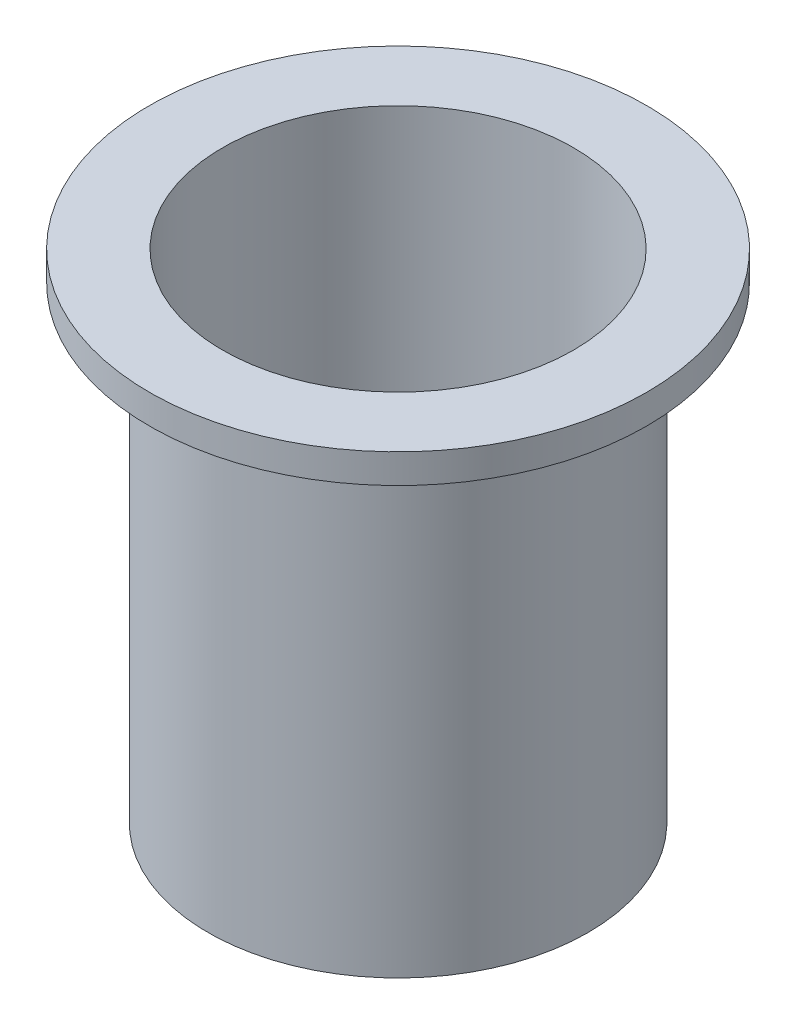
ISO-10303-21;
HEADER;
FILE_DESCRIPTION(('STEP AP214'),'2;1');
FILE_NAME('part.step','',(''),(''),'','','');
FILE_SCHEMA(('AUTOMOTIVE_DESIGN { 1 0 10303 214 1 1 1 1 }'));
ENDSEC;
DATA;
#1=APPLICATION_CONTEXT('core data for automotive mechanical design processes');
#2=APPLICATION_PROTOCOL_DEFINITION('international standard','automotive_design',2000,#1);
#3=PRODUCT_CONTEXT('',#1,'mechanical');
#4=PRODUCT('Part','Part','',(#3));
#5=PRODUCT_RELATED_PRODUCT_CATEGORY('part','',(#4));
#6=PRODUCT_DEFINITION_FORMATION('','',#4);
#7=PRODUCT_DEFINITION_CONTEXT('part definition',#1,'design');
#8=PRODUCT_DEFINITION('design','',#6,#7);
#9=PRODUCT_DEFINITION_SHAPE('','',#8);
#10=(LENGTH_UNIT() NAMED_UNIT(*) SI_UNIT(.MILLI.,.METRE.));
#11=(NAMED_UNIT(*) PLANE_ANGLE_UNIT() SI_UNIT($,.RADIAN.));
#12=(NAMED_UNIT(*) SI_UNIT($,.STERADIAN.) SOLID_ANGLE_UNIT());
#13=UNCERTAINTY_MEASURE_WITH_UNIT(LENGTH_MEASURE(1.E-05),#10,'distance_accuracy_value','');
#14=(GEOMETRIC_REPRESENTATION_CONTEXT(3) GLOBAL_UNCERTAINTY_ASSIGNED_CONTEXT((#13)) GLOBAL_UNIT_ASSIGNED_CONTEXT((#10,
#11,#12)) REPRESENTATION_CONTEXT('',''));
#15=CARTESIAN_POINT('',(0.,0.,0.));
#16=DIRECTION('',(0.,0.,1.));
#17=DIRECTION('',(1.,0.,0.));
#18=AXIS2_PLACEMENT_3D('',#15,#16,#17);
#19=CARTESIAN_POINT('',(0.,3.17499999999993,0.));
#20=DIRECTION('',(0.,1.,0.));
#21=DIRECTION('',(-1.,0.,0.));
#22=AXIS2_PLACEMENT_3D('',#19,#20,#21);
#23=PLANE('',#22);
#24=CARTESIAN_POINT('',(0.,3.17499999999993,0.));
#25=DIRECTION('',(0.,-1.,0.));
#26=DIRECTION('',(1.,0.,0.));
#27=AXIS2_PLACEMENT_3D('',#24,#25,#26);
#28=CIRCLE('',#27,38.1);
#29=CARTESIAN_POINT('',(38.1,3.17500000000006,0.));
#30=VERTEX_POINT('',#29);
#31=EDGE_CURVE('E10',#30,#30,#28,.T.);
#32=ORIENTED_EDGE('',*,*,#31,.F.);
#33=EDGE_LOOP('',(#32));
#34=FACE_BOUND('',#33,.T.);
#35=ADVANCED_FACE('F35',(#34),#23,.T.);
#36=CARTESIAN_POINT('',(1.93565135947845E-12,-554.392583441334,0.));
#37=DIRECTION('',(0.,-1.,0.));
#38=DIRECTION('',(1.,0.,0.));
#39=AXIS2_PLACEMENT_3D('',#36,#37,#38);
#40=CYLINDRICAL_SURFACE('',#39,38.1000000000004);
#41=ORIENTED_EDGE('',*,*,#31,.T.);
#42=EDGE_LOOP('',(#41));
#43=FACE_BOUND('',#42,.T.);
#44=CARTESIAN_POINT('',(-3.76905410528115E-13,107.95,0.));
#45=DIRECTION('',(0.,-1.,0.));
#46=DIRECTION('',(1.,0.,0.));
#47=AXIS2_PLACEMENT_3D('',#44,#45,#46);
#48=CIRCLE('',#47,38.1000000000008);
#49=CARTESIAN_POINT('',(38.1000000000004,107.95,0.));
#50=VERTEX_POINT('',#49);
#51=EDGE_CURVE('E41',#50,#50,#48,.T.);
#52=ORIENTED_EDGE('',*,*,#51,.F.);
#53=EDGE_LOOP('',(#52));
#54=FACE_BOUND('',#53,.T.);
#55=ADVANCED_FACE('F77',(#43,#54),#40,.F.);
#56=CARTESIAN_POINT('',(41.2750000000004,107.95,0.));
#57=DIRECTION('',(0.,1.,0.));
#58=DIRECTION('',(-1.,0.,0.));
#59=AXIS2_PLACEMENT_3D('',#56,#57,#58);
#60=PLANE('',#59);
#61=ORIENTED_EDGE('',*,*,#51,.T.);
#62=EDGE_LOOP('',(#61));
#63=FACE_BOUND('',#62,.T.);
#64=CARTESIAN_POINT('',(-3.76905410528115E-13,107.95,0.));
#65=DIRECTION('',(0.,-1.,0.));
#66=DIRECTION('',(1.,0.,0.));
#67=AXIS2_PLACEMENT_3D('',#64,#65,#66);
#68=CIRCLE('',#67,53.9750000000008);
#69=CARTESIAN_POINT('',(53.9750000000004,107.95,0.));
#70=VERTEX_POINT('',#69);
#71=EDGE_CURVE('E45',#70,#70,#68,.T.);
#72=ORIENTED_EDGE('',*,*,#71,.F.);
#73=EDGE_LOOP('',(#72));
#74=FACE_BOUND('',#73,.T.);
#75=ADVANCED_FACE('F82',(#63,#74),#60,.T.);
#76=CARTESIAN_POINT('',(1.93565135947845E-12,-554.392583441334,0.));
#77=DIRECTION('',(0.,-1.,0.));
#78=DIRECTION('',(1.,0.,0.));
#79=AXIS2_PLACEMENT_3D('',#76,#77,#78);
#80=CYLINDRICAL_SURFACE('',#79,53.9750000000008);
#81=ORIENTED_EDGE('',*,*,#71,.T.);
#82=EDGE_LOOP('',(#81));
#83=FACE_BOUND('',#82,.T.);
#84=CARTESIAN_POINT('',(-3.54734504026461E-13,101.6,0.));
#85=DIRECTION('',(0.,-1.,0.));
#86=DIRECTION('',(1.,0.,0.));
#87=AXIS2_PLACEMENT_3D('',#84,#85,#86);
#88=CIRCLE('',#87,53.9750000000008);
#89=CARTESIAN_POINT('',(53.9750000000004,101.6,0.));
#90=VERTEX_POINT('',#89);
#91=EDGE_CURVE('E49',#90,#90,#88,.T.);
#92=ORIENTED_EDGE('',*,*,#91,.F.);
#93=EDGE_LOOP('',(#92));
#94=FACE_BOUND('',#93,.T.);
#95=ADVANCED_FACE('F73',(#83,#94),#80,.T.);
#96=CARTESIAN_POINT('',(41.2750000000004,101.6,0.));
#97=DIRECTION('',(0.,-1.,0.));
#98=DIRECTION('',(1.,0.,0.));
#99=AXIS2_PLACEMENT_3D('',#96,#97,#98);
#100=PLANE('',#99);
#101=ORIENTED_EDGE('',*,*,#91,.T.);
#102=EDGE_LOOP('',(#101));
#103=FACE_BOUND('',#102,.T.);
#104=CARTESIAN_POINT('',(-3.54734504026461E-13,101.6,0.));
#105=DIRECTION('',(0.,-1.,0.));
#106=DIRECTION('',(1.,0.,0.));
#107=AXIS2_PLACEMENT_3D('',#104,#105,#106);
#108=CIRCLE('',#107,41.2750000000008);
#109=CARTESIAN_POINT('',(41.2750000000004,101.6,0.));
#110=VERTEX_POINT('',#109);
#111=EDGE_CURVE('E54',#110,#110,#108,.T.);
#112=ORIENTED_EDGE('',*,*,#111,.F.);
#113=EDGE_LOOP('',(#112));
#114=FACE_BOUND('',#113,.T.);
#115=ADVANCED_FACE('F65',(#103,#114),#100,.T.);
#116=CARTESIAN_POINT('',(1.93565135947845E-12,-554.392583441334,0.));
#117=DIRECTION('',(0.,-1.,0.));
#118=DIRECTION('',(1.,0.,0.));
#119=AXIS2_PLACEMENT_3D('',#116,#117,#118);
#120=CYLINDRICAL_SURFACE('',#119,41.2750000000004);
#121=ORIENTED_EDGE('',*,*,#111,.T.);
#122=EDGE_LOOP('',(#121));
#123=FACE_BOUND('',#122,.T.);
#124=CARTESIAN_POINT('',(0.,-1.11022302462516E-13,0.));
#125=DIRECTION('',(0.,-1.,0.));
#126=DIRECTION('',(1.,0.,0.));
#127=AXIS2_PLACEMENT_3D('',#124,#125,#126);
#128=CIRCLE('',#127,41.275);
#129=CARTESIAN_POINT('',(41.275,0.,0.));
#130=VERTEX_POINT('',#129);
#131=EDGE_CURVE('E57',#130,#130,#128,.T.);
#132=ORIENTED_EDGE('',*,*,#131,.F.);
#133=EDGE_LOOP('',(#132));
#134=FACE_BOUND('',#133,.T.);
#135=ADVANCED_FACE('F63',(#123,#134),#120,.T.);
#136=CARTESIAN_POINT('',(41.275,0.,0.));
#137=DIRECTION('',(0.,-1.,0.));
#138=DIRECTION('',(1.,0.,0.));
#139=AXIS2_PLACEMENT_3D('',#136,#137,#138);
#140=PLANE('',#139);
#141=ORIENTED_EDGE('',*,*,#131,.T.);
#142=EDGE_LOOP('',(#141));
#143=FACE_BOUND('',#142,.T.);
#144=ADVANCED_FACE('F61',(#143),#140,.T.);
#145=CLOSED_SHELL('',(#35,#55,#75,#95,#115,#135,#144));
#146=MANIFOLD_SOLID_BREP('B2',#145);
#147=ADVANCED_BREP_SHAPE_REPRESENTATION('',(#18,#146),#14);
#148=SHAPE_DEFINITION_REPRESENTATION(#9,#147);
ENDSEC;
END-ISO-10303-21;
